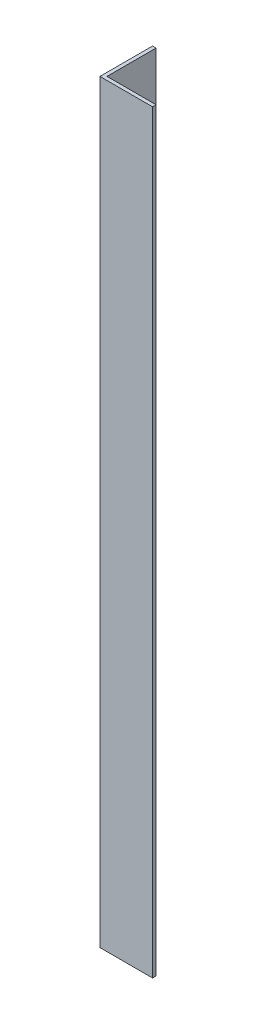
ISO-10303-21;
HEADER;
FILE_DESCRIPTION(('STEP AP214'),'2;1');
FILE_NAME('part.step','',(''),(''),'','','');
FILE_SCHEMA(('AUTOMOTIVE_DESIGN { 1 0 10303 214 1 1 1 1 }'));
ENDSEC;
DATA;
#1=APPLICATION_CONTEXT('core data for automotive mechanical design processes');
#2=APPLICATION_PROTOCOL_DEFINITION('international standard','automotive_design',2000,#1);
#3=PRODUCT_CONTEXT('',#1,'mechanical');
#4=PRODUCT('Part','Part','',(#3));
#5=PRODUCT_RELATED_PRODUCT_CATEGORY('part','',(#4));
#6=PRODUCT_DEFINITION_FORMATION('','',#4);
#7=PRODUCT_DEFINITION_CONTEXT('part definition',#1,'design');
#8=PRODUCT_DEFINITION('design','',#6,#7);
#9=PRODUCT_DEFINITION_SHAPE('','',#8);
#10=(LENGTH_UNIT() NAMED_UNIT(*) SI_UNIT(.MILLI.,.METRE.));
#11=(NAMED_UNIT(*) PLANE_ANGLE_UNIT() SI_UNIT($,.RADIAN.));
#12=(NAMED_UNIT(*) SI_UNIT($,.STERADIAN.) SOLID_ANGLE_UNIT());
#13=UNCERTAINTY_MEASURE_WITH_UNIT(LENGTH_MEASURE(1.E-05),#10,'distance_accuracy_value','');
#14=(GEOMETRIC_REPRESENTATION_CONTEXT(3) GLOBAL_UNCERTAINTY_ASSIGNED_CONTEXT((#13)) GLOBAL_UNIT_ASSIGNED_CONTEXT((#10,
#11,#12)) REPRESENTATION_CONTEXT('',''));
#15=CARTESIAN_POINT('',(0.,0.,0.));
#16=DIRECTION('',(0.,0.,1.));
#17=DIRECTION('',(1.,0.,0.));
#18=AXIS2_PLACEMENT_3D('',#15,#16,#17);
#19=CARTESIAN_POINT('',(15.,215.,0.));
#20=DIRECTION('',(0.,0.,-1.));
#21=DIRECTION('',(-1.,0.,0.));
#22=AXIS2_PLACEMENT_3D('',#19,#20,#21);
#23=PLANE('',#22);
#24=DIRECTION('',(1.,0.,0.));
#25=VECTOR('',#24,1.);
#26=CARTESIAN_POINT('',(15.,0.,0.));
#27=LINE('',#26,#25);
#28=CARTESIAN_POINT('',(0.,0.,0.));
#29=VERTEX_POINT('',#28);
#30=CARTESIAN_POINT('',(15.,0.,0.));
#31=VERTEX_POINT('',#30);
#32=EDGE_CURVE('E121',#29,#31,#27,.T.);
#33=ORIENTED_EDGE('',*,*,#32,.T.);
#34=DIRECTION('',(0.,-1.,0.));
#35=VECTOR('',#34,1.);
#36=CARTESIAN_POINT('',(15.,215.,0.));
#37=LINE('',#36,#35);
#38=CARTESIAN_POINT('',(15.,215.,0.));
#39=VERTEX_POINT('',#38);
#40=EDGE_CURVE('E11',#39,#31,#37,.T.);
#41=ORIENTED_EDGE('',*,*,#40,.F.);
#42=DIRECTION('',(1.,0.,0.));
#43=VECTOR('',#42,1.);
#44=CARTESIAN_POINT('',(15.,215.,0.));
#45=LINE('',#44,#43);
#46=CARTESIAN_POINT('',(0.,215.,0.));
#47=VERTEX_POINT('',#46);
#48=EDGE_CURVE('E131',#47,#39,#45,.T.);
#49=ORIENTED_EDGE('',*,*,#48,.F.);
#50=DIRECTION('',(0.,-1.,0.));
#51=VECTOR('',#50,1.);
#52=CARTESIAN_POINT('',(0.,215.,0.));
#53=LINE('',#52,#51);
#54=EDGE_CURVE('E117',#47,#29,#53,.T.);
#55=ORIENTED_EDGE('',*,*,#54,.T.);
#56=EDGE_LOOP('',(#33,#41,#49,#55));
#57=FACE_BOUND('',#56,.T.);
#58=ADVANCED_FACE('F37',(#57),#23,.F.);
#59=CARTESIAN_POINT('',(15.,215.,-0.999999999999998));
#60=DIRECTION('',(-1.,0.,0.));
#61=DIRECTION('',(0.,0.,1.));
#62=AXIS2_PLACEMENT_3D('',#59,#60,#61);
#63=PLANE('',#62);
#64=DIRECTION('',(0.,0.,-1.));
#65=VECTOR('',#64,1.);
#66=CARTESIAN_POINT('',(15.,0.,-0.999999999999998));
#67=LINE('',#66,#65);
#68=CARTESIAN_POINT('',(15.,0.,-0.999999999999998));
#69=VERTEX_POINT('',#68);
#70=EDGE_CURVE('E124',#31,#69,#67,.T.);
#71=ORIENTED_EDGE('',*,*,#70,.T.);
#72=DIRECTION('',(0.,-1.,0.));
#73=VECTOR('',#72,1.);
#74=CARTESIAN_POINT('',(15.,215.,-0.999999999999998));
#75=LINE('',#74,#73);
#76=CARTESIAN_POINT('',(15.,215.,-0.999999999999998));
#77=VERTEX_POINT('',#76);
#78=EDGE_CURVE('E45',#77,#69,#75,.T.);
#79=ORIENTED_EDGE('',*,*,#78,.F.);
#80=DIRECTION('',(0.,0.,-1.));
#81=VECTOR('',#80,1.);
#82=CARTESIAN_POINT('',(15.,215.,-0.999999999999998));
#83=LINE('',#82,#81);
#84=EDGE_CURVE('E90',#39,#77,#83,.T.);
#85=ORIENTED_EDGE('',*,*,#84,.F.);
#86=ORIENTED_EDGE('',*,*,#40,.T.);
#87=EDGE_LOOP('',(#71,#79,#85,#86));
#88=FACE_BOUND('',#87,.T.);
#89=ADVANCED_FACE('F155',(#88),#63,.F.);
#90=CARTESIAN_POINT('',(1.,215.,-0.999999999999997));
#91=DIRECTION('',(0.,0.,1.));
#92=DIRECTION('',(1.,0.,0.));
#93=AXIS2_PLACEMENT_3D('',#90,#91,#92);
#94=PLANE('',#93);
#95=DIRECTION('',(-1.,0.,0.));
#96=VECTOR('',#95,1.);
#97=CARTESIAN_POINT('',(1.,0.,-0.999999999999997));
#98=LINE('',#97,#96);
#99=CARTESIAN_POINT('',(1.,0.,-0.999999999999997));
#100=VERTEX_POINT('',#99);
#101=EDGE_CURVE('E126',#69,#100,#98,.T.);
#102=ORIENTED_EDGE('',*,*,#101,.T.);
#103=DIRECTION('',(0.,-1.,0.));
#104=VECTOR('',#103,1.);
#105=CARTESIAN_POINT('',(1.,215.,-0.999999999999997));
#106=LINE('',#105,#104);
#107=CARTESIAN_POINT('',(1.,215.,-0.999999999999997));
#108=VERTEX_POINT('',#107);
#109=EDGE_CURVE('E112',#108,#100,#106,.T.);
#110=ORIENTED_EDGE('',*,*,#109,.F.);
#111=DIRECTION('',(-1.,0.,0.));
#112=VECTOR('',#111,1.);
#113=CARTESIAN_POINT('',(1.,215.,-0.999999999999997));
#114=LINE('',#113,#112);
#115=EDGE_CURVE('E103',#77,#108,#114,.T.);
#116=ORIENTED_EDGE('',*,*,#115,.F.);
#117=ORIENTED_EDGE('',*,*,#78,.T.);
#118=EDGE_LOOP('',(#102,#110,#116,#117));
#119=FACE_BOUND('',#118,.T.);
#120=ADVANCED_FACE('F137',(#119),#94,.F.);
#121=CARTESIAN_POINT('',(0.999999999999998,215.,-15.));
#122=DIRECTION('',(-1.,0.,0.));
#123=DIRECTION('',(0.,0.,1.));
#124=AXIS2_PLACEMENT_3D('',#121,#122,#123);
#125=PLANE('',#124);
#126=DIRECTION('',(0.,0.,-1.));
#127=VECTOR('',#126,1.);
#128=CARTESIAN_POINT('',(0.999999999999998,0.,-15.));
#129=LINE('',#128,#127);
#130=CARTESIAN_POINT('',(0.999999999999998,0.,-15.));
#131=VERTEX_POINT('',#130);
#132=EDGE_CURVE('E111',#100,#131,#129,.T.);
#133=ORIENTED_EDGE('',*,*,#132,.T.);
#134=DIRECTION('',(0.,-1.,0.));
#135=VECTOR('',#134,1.);
#136=CARTESIAN_POINT('',(0.999999999999998,215.,-15.));
#137=LINE('',#136,#135);
#138=CARTESIAN_POINT('',(0.999999999999998,215.,-15.));
#139=VERTEX_POINT('',#138);
#140=EDGE_CURVE('E108',#139,#131,#137,.T.);
#141=ORIENTED_EDGE('',*,*,#140,.F.);
#142=DIRECTION('',(0.,0.,-1.));
#143=VECTOR('',#142,1.);
#144=CARTESIAN_POINT('',(0.999999999999998,215.,-15.));
#145=LINE('',#144,#143);
#146=EDGE_CURVE('E97',#108,#139,#145,.T.);
#147=ORIENTED_EDGE('',*,*,#146,.F.);
#148=ORIENTED_EDGE('',*,*,#109,.T.);
#149=EDGE_LOOP('',(#133,#141,#147,#148));
#150=FACE_BOUND('',#149,.T.);
#151=ADVANCED_FACE('F109',(#150),#125,.F.);
#152=CARTESIAN_POINT('',(0.,215.,-15.));
#153=DIRECTION('',(0.,0.,1.));
#154=DIRECTION('',(1.,0.,0.));
#155=AXIS2_PLACEMENT_3D('',#152,#153,#154);
#156=PLANE('',#155);
#157=DIRECTION('',(-1.,0.,0.));
#158=VECTOR('',#157,1.);
#159=CARTESIAN_POINT('',(0.,0.,-15.));
#160=LINE('',#159,#158);
#161=CARTESIAN_POINT('',(0.,0.,-15.));
#162=VERTEX_POINT('',#161);
#163=EDGE_CURVE('E76',#131,#162,#160,.T.);
#164=ORIENTED_EDGE('',*,*,#163,.T.);
#165=DIRECTION('',(0.,-1.,0.));
#166=VECTOR('',#165,1.);
#167=CARTESIAN_POINT('',(0.,215.,-15.));
#168=LINE('',#167,#166);
#169=CARTESIAN_POINT('',(0.,215.,-15.));
#170=VERTEX_POINT('',#169);
#171=EDGE_CURVE('E113',#170,#162,#168,.T.);
#172=ORIENTED_EDGE('',*,*,#171,.F.);
#173=DIRECTION('',(-1.,0.,0.));
#174=VECTOR('',#173,1.);
#175=CARTESIAN_POINT('',(0.,215.,-15.));
#176=LINE('',#175,#174);
#177=EDGE_CURVE('E101',#139,#170,#176,.T.);
#178=ORIENTED_EDGE('',*,*,#177,.F.);
#179=ORIENTED_EDGE('',*,*,#140,.T.);
#180=EDGE_LOOP('',(#164,#172,#178,#179));
#181=FACE_BOUND('',#180,.T.);
#182=ADVANCED_FACE('F115',(#181),#156,.F.);
#183=CARTESIAN_POINT('',(0.,215.,0.));
#184=DIRECTION('',(1.,0.,0.));
#185=DIRECTION('',(0.,0.,-1.));
#186=AXIS2_PLACEMENT_3D('',#183,#184,#185);
#187=PLANE('',#186);
#188=DIRECTION('',(0.,0.,1.));
#189=VECTOR('',#188,1.);
#190=CARTESIAN_POINT('',(0.,0.,0.));
#191=LINE('',#190,#189);
#192=EDGE_CURVE('E82',#162,#29,#191,.T.);
#193=ORIENTED_EDGE('',*,*,#192,.T.);
#194=ORIENTED_EDGE('',*,*,#54,.F.);
#195=DIRECTION('',(0.,0.,1.));
#196=VECTOR('',#195,1.);
#197=CARTESIAN_POINT('',(0.,215.,0.));
#198=LINE('',#197,#196);
#199=EDGE_CURVE('E53',#170,#47,#198,.T.);
#200=ORIENTED_EDGE('',*,*,#199,.F.);
#201=ORIENTED_EDGE('',*,*,#171,.T.);
#202=EDGE_LOOP('',(#193,#194,#200,#201));
#203=FACE_BOUND('',#202,.T.);
#204=ADVANCED_FACE('F144',(#203),#187,.F.);
#205=CARTESIAN_POINT('',(0.,215.,0.));
#206=DIRECTION('',(0.,-1.,0.));
#207=DIRECTION('',(0.,0.,-1.));
#208=AXIS2_PLACEMENT_3D('',#205,#206,#207);
#209=PLANE('',#208);
#210=ORIENTED_EDGE('',*,*,#48,.T.);
#211=ORIENTED_EDGE('',*,*,#84,.T.);
#212=ORIENTED_EDGE('',*,*,#115,.T.);
#213=ORIENTED_EDGE('',*,*,#146,.T.);
#214=ORIENTED_EDGE('',*,*,#177,.T.);
#215=ORIENTED_EDGE('',*,*,#199,.T.);
#216=EDGE_LOOP('',(#210,#211,#212,#213,#214,#215));
#217=FACE_BOUND('',#216,.T.);
#218=ADVANCED_FACE('F99',(#217),#209,.F.);
#219=CARTESIAN_POINT('',(0.,0.,0.));
#220=DIRECTION('',(0.,-1.,0.));
#221=DIRECTION('',(0.,0.,-1.));
#222=AXIS2_PLACEMENT_3D('',#219,#220,#221);
#223=PLANE('',#222);
#224=ORIENTED_EDGE('',*,*,#32,.F.);
#225=ORIENTED_EDGE('',*,*,#192,.F.);
#226=ORIENTED_EDGE('',*,*,#163,.F.);
#227=ORIENTED_EDGE('',*,*,#132,.F.);
#228=ORIENTED_EDGE('',*,*,#101,.F.);
#229=ORIENTED_EDGE('',*,*,#70,.F.);
#230=EDGE_LOOP('',(#224,#225,#226,#227,#228,#229));
#231=FACE_BOUND('',#230,.T.);
#232=ADVANCED_FACE('F140',(#231),#223,.T.);
#233=CLOSED_SHELL('',(#58,#89,#120,#151,#182,#204,#218,#232));
#234=MANIFOLD_SOLID_BREP('B2',#233);
#235=ADVANCED_BREP_SHAPE_REPRESENTATION('',(#18,#234),#14);
#236=SHAPE_DEFINITION_REPRESENTATION(#9,#235);
ENDSEC;
END-ISO-10303-21;
